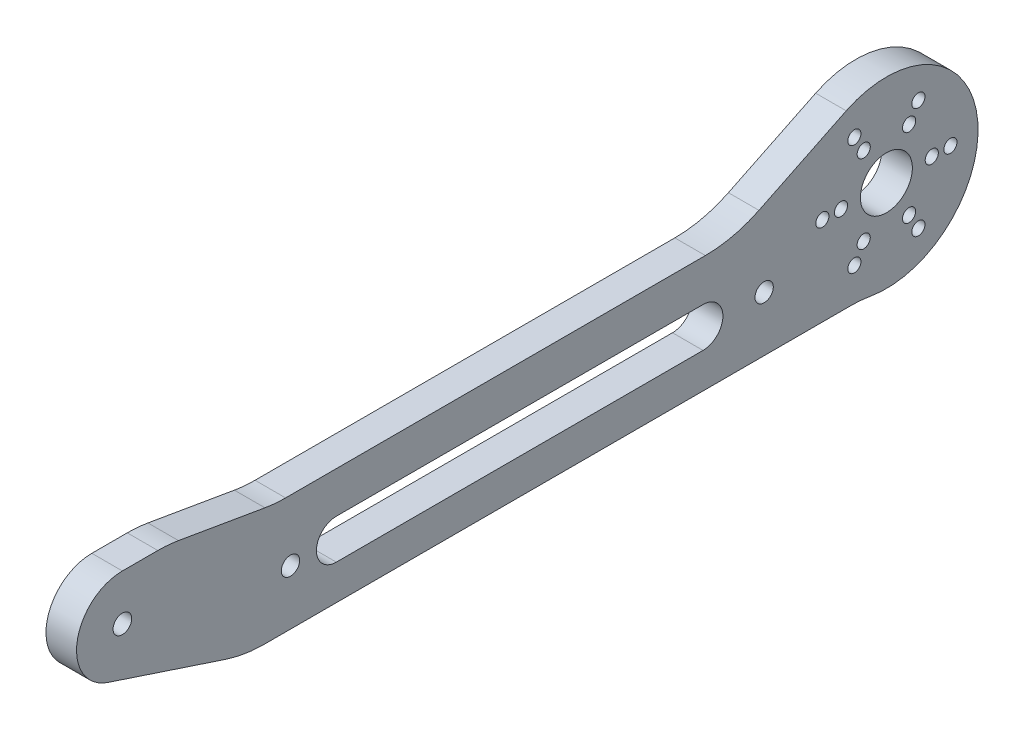
ISO-10303-21;
HEADER;
FILE_DESCRIPTION(('STEP AP214'),'2;1');
FILE_NAME('part.step','',(''),(''),'','','');
FILE_SCHEMA(('AUTOMOTIVE_DESIGN { 1 0 10303 214 1 1 1 1 }'));
ENDSEC;
DATA;
#1=APPLICATION_CONTEXT('core data for automotive mechanical design processes');
#2=APPLICATION_PROTOCOL_DEFINITION('international standard','automotive_design',2000,#1);
#3=PRODUCT_CONTEXT('',#1,'mechanical');
#4=PRODUCT('Part','Part','',(#3));
#5=PRODUCT_RELATED_PRODUCT_CATEGORY('part','',(#4));
#6=PRODUCT_DEFINITION_FORMATION('','',#4);
#7=PRODUCT_DEFINITION_CONTEXT('part definition',#1,'design');
#8=PRODUCT_DEFINITION('design','',#6,#7);
#9=PRODUCT_DEFINITION_SHAPE('','',#8);
#10=(LENGTH_UNIT() NAMED_UNIT(*) SI_UNIT(.MILLI.,.METRE.));
#11=(NAMED_UNIT(*) PLANE_ANGLE_UNIT() SI_UNIT($,.RADIAN.));
#12=(NAMED_UNIT(*) SI_UNIT($,.STERADIAN.) SOLID_ANGLE_UNIT());
#13=UNCERTAINTY_MEASURE_WITH_UNIT(LENGTH_MEASURE(1.E-05),#10,'distance_accuracy_value','');
#14=(GEOMETRIC_REPRESENTATION_CONTEXT(3) GLOBAL_UNCERTAINTY_ASSIGNED_CONTEXT((#13)) GLOBAL_UNIT_ASSIGNED_CONTEXT((#10,
#11,#12)) REPRESENTATION_CONTEXT('',''));
#15=CARTESIAN_POINT('',(0.,0.,0.));
#16=DIRECTION('',(0.,0.,1.));
#17=DIRECTION('',(1.,0.,0.));
#18=AXIS2_PLACEMENT_3D('',#15,#16,#17);
#19=CARTESIAN_POINT('',(-2.5,0.,0.));
#20=DIRECTION('',(1.,0.,0.));
#21=DIRECTION('',(0.,0.,-1.));
#22=AXIS2_PLACEMENT_3D('',#19,#20,#21);
#23=PLANE('',#22);
#24=CARTESIAN_POINT('',(-2.5,0.,125.));
#25=DIRECTION('',(-1.,0.,0.));
#26=DIRECTION('',(0.,0.,1.));
#27=AXIS2_PLACEMENT_3D('',#24,#25,#26);
#28=CIRCLE('',#27,1.525);
#29=CARTESIAN_POINT('',(-2.5,0.,126.525));
#30=VERTEX_POINT('',#29);
#31=EDGE_CURVE('E269',#30,#30,#28,.F.);
#32=ORIENTED_EDGE('',*,*,#31,.T.);
#33=EDGE_LOOP('',(#32));
#34=FACE_BOUND('',#33,.T.);
#35=CARTESIAN_POINT('',(-2.5,-5.50000000000001,97.5));
#36=DIRECTION('',(-1.,0.,0.));
#37=DIRECTION('',(0.,0.,1.));
#38=AXIS2_PLACEMENT_3D('',#35,#36,#37);
#39=CIRCLE('',#38,1.5);
#40=CARTESIAN_POINT('',(-2.5,-5.50000000000001,99.));
#41=VERTEX_POINT('',#40);
#42=EDGE_CURVE('E272',#41,#41,#39,.F.);
#43=ORIENTED_EDGE('',*,*,#42,.T.);
#44=EDGE_LOOP('',(#43));
#45=FACE_BOUND('',#44,.T.);
#46=CARTESIAN_POINT('',(-2.5,-5.5,20.));
#47=DIRECTION('',(-1.,0.,0.));
#48=DIRECTION('',(0.,0.,1.));
#49=AXIS2_PLACEMENT_3D('',#46,#47,#48);
#50=CIRCLE('',#49,1.5);
#51=CARTESIAN_POINT('',(-2.5,-5.5,21.5));
#52=VERTEX_POINT('',#51);
#53=EDGE_CURVE('E168',#52,#52,#50,.F.);
#54=ORIENTED_EDGE('',*,*,#53,.T.);
#55=EDGE_LOOP('',(#54));
#56=FACE_BOUND('',#55,.T.);
#57=DIRECTION('',(0.,0.,1.));
#58=VECTOR('',#57,1.);
#59=CARTESIAN_POINT('',(-2.5,-2.24999999999998,0.));
#60=LINE('',#59,#58);
#61=CARTESIAN_POINT('',(-2.5,-2.24999999999999,30.));
#62=VERTEX_POINT('',#61);
#63=CARTESIAN_POINT('',(-2.5,-2.25,90.));
#64=VERTEX_POINT('',#63);
#65=EDGE_CURVE('E165',#62,#64,#60,.T.);
#66=ORIENTED_EDGE('',*,*,#65,.T.);
#67=CARTESIAN_POINT('',(-2.5,-5.5,90.));
#68=DIRECTION('',(-1.,0.,0.));
#69=DIRECTION('',(0.,0.,1.));
#70=AXIS2_PLACEMENT_3D('',#67,#68,#69);
#71=CIRCLE('',#70,3.25);
#72=CARTESIAN_POINT('',(-2.5,-8.75,90.));
#73=VERTEX_POINT('',#72);
#74=EDGE_CURVE('E277',#64,#73,#71,.F.);
#75=ORIENTED_EDGE('',*,*,#74,.T.);
#76=DIRECTION('',(0.,0.,1.));
#77=VECTOR('',#76,1.);
#78=CARTESIAN_POINT('',(-2.5,-8.74999999999998,0.));
#79=LINE('',#78,#77);
#80=CARTESIAN_POINT('',(-2.5,-8.74999999999999,30.));
#81=VERTEX_POINT('',#80);
#82=EDGE_CURVE('E170',#81,#73,#79,.T.);
#83=ORIENTED_EDGE('',*,*,#82,.F.);
#84=CARTESIAN_POINT('',(-2.5,-5.49999999999999,30.));
#85=DIRECTION('',(-1.,0.,0.));
#86=DIRECTION('',(0.,0.,1.));
#87=AXIS2_PLACEMENT_3D('',#84,#85,#86);
#88=CIRCLE('',#87,3.25);
#89=EDGE_CURVE('E174',#81,#62,#88,.F.);
#90=ORIENTED_EDGE('',*,*,#89,.T.);
#91=EDGE_LOOP('',(#66,#75,#83,#90));
#92=FACE_BOUND('',#91,.T.);
#93=CARTESIAN_POINT('',(-2.5,-12.5,119.201872697098));
#94=DIRECTION('',(-1.,0.,0.));
#95=DIRECTION('',(0.,0.,1.));
#96=AXIS2_PLACEMENT_3D('',#93,#94,#95);
#97=CIRCLE('',#96,20.);
#98=CARTESIAN_POINT('',(-2.5,7.21244509626534,115.822596394881));
#99=VERTEX_POINT('',#98);
#100=CARTESIAN_POINT('',(-2.5,7.5,119.201872697098));
#101=VERTEX_POINT('',#100);
#102=EDGE_CURVE('E137',#99,#101,#97,.F.);
#103=ORIENTED_EDGE('',*,*,#102,.F.);
#104=DIRECTION('',(0.,0.168963815110846,0.985622254813267));
#105=VECTOR('',#104,1.);
#106=CARTESIAN_POINT('',(-2.5,-12.281919111816,2.10547184773989));
#107=LINE('',#106,#105);
#108=CARTESIAN_POINT('',(-2.5,4.78755490373467,101.677403605119));
#109=VERTEX_POINT('',#108);
#110=EDGE_CURVE('E132',#109,#99,#107,.T.);
#111=ORIENTED_EDGE('',*,*,#110,.F.);
#112=CARTESIAN_POINT('',(-2.5,24.5,98.2981273029019));
#113=DIRECTION('',(1.,0.,0.));
#114=DIRECTION('',(0.,0.,-1.));
#115=AXIS2_PLACEMENT_3D('',#112,#113,#114);
#116=CIRCLE('',#115,20.);
#117=CARTESIAN_POINT('',(-2.5,4.5,98.2981273029019));
#118=VERTEX_POINT('',#117);
#119=EDGE_CURVE('E283',#109,#118,#116,.T.);
#120=ORIENTED_EDGE('',*,*,#119,.T.);
#121=DIRECTION('',(0.,0.,1.));
#122=VECTOR('',#121,1.);
#123=CARTESIAN_POINT('',(-2.5,4.50000000000002,0.));
#124=LINE('',#123,#122);
#125=CARTESIAN_POINT('',(-2.5,4.50000000000001,29.6153846153846));
#126=VERTEX_POINT('',#125);
#127=EDGE_CURVE('E175',#126,#118,#124,.T.);
#128=ORIENTED_EDGE('',*,*,#127,.F.);
#129=CARTESIAN_POINT('',(-2.5,24.5,29.6153846153846));
#130=DIRECTION('',(1.,0.,0.));
#131=DIRECTION('',(0.,0.,-1.));
#132=AXIS2_PLACEMENT_3D('',#129,#130,#131);
#133=CIRCLE('',#132,20.);
#134=CARTESIAN_POINT('',(-2.5,6.52247191011236,20.8513396715644));
#135=VERTEX_POINT('',#134);
#136=EDGE_CURVE('E286',#126,#135,#133,.T.);
#137=ORIENTED_EDGE('',*,*,#136,.T.);
#138=DIRECTION('',(0.,-0.438202247191011,0.898876404494382));
#139=VECTOR('',#138,1.);
#140=CARTESIAN_POINT('',(-2.5,13.4831460674157,6.57303370786516));
#141=LINE('',#140,#139);
#142=CARTESIAN_POINT('',(-2.5,13.4831460674157,6.57303370786516));
#143=VERTEX_POINT('',#142);
#144=EDGE_CURVE('E182',#143,#135,#141,.T.);
#145=ORIENTED_EDGE('',*,*,#144,.F.);
#146=CARTESIAN_POINT('',(-2.5,0.,0.));
#147=DIRECTION('',(-1.,0.,0.));
#148=DIRECTION('',(0.,0.,1.));
#149=AXIS2_PLACEMENT_3D('',#146,#147,#148);
#150=CIRCLE('',#149,15.);
#151=CARTESIAN_POINT('',(-2.5,-14.7857142857143,2.52639131197534));
#152=VERTEX_POINT('',#151);
#153=EDGE_CURVE('E186',#152,#143,#150,.F.);
#154=ORIENTED_EDGE('',*,*,#153,.F.);
#155=CARTESIAN_POINT('',(-2.5,-34.5,5.8949130612758));
#156=DIRECTION('',(-1.,0.,0.));
#157=DIRECTION('',(0.,0.,1.));
#158=AXIS2_PLACEMENT_3D('',#155,#156,#157);
#159=CIRCLE('',#158,20.);
#160=CARTESIAN_POINT('',(-2.5,-14.5,5.8949130612758));
#161=VERTEX_POINT('',#160);
#162=EDGE_CURVE('E190',#152,#161,#159,.F.);
#163=ORIENTED_EDGE('',*,*,#162,.T.);
#164=DIRECTION('',(0.,0.,1.));
#165=VECTOR('',#164,1.);
#166=CARTESIAN_POINT('',(-2.5,-14.5,0.));
#167=LINE('',#166,#165);
#168=CARTESIAN_POINT('',(-2.5,-14.5,101.784359461928));
#169=VERTEX_POINT('',#168);
#170=EDGE_CURVE('E187',#161,#169,#167,.T.);
#171=ORIENTED_EDGE('',*,*,#170,.T.);
#172=CARTESIAN_POINT('',(-2.5,5.49999999999998,101.784359461928));
#173=DIRECTION('',(1.,0.,0.));
#174=DIRECTION('',(0.,0.,-1.));
#175=AXIS2_PLACEMENT_3D('',#172,#173,#174);
#176=CIRCLE('',#175,20.);
#177=CARTESIAN_POINT('',(-2.5,-13.4920226739072,108.05357590051));
#178=VERTEX_POINT('',#177);
#179=EDGE_CURVE('E293',#178,#169,#176,.T.);
#180=ORIENTED_EDGE('',*,*,#179,.F.);
#181=DIRECTION('',(0.,-0.313460821929136,-0.949601133695359));
#182=VECTOR('',#181,1.);
#183=CARTESIAN_POINT('',(-2.5,-44.3298524868385,14.6331670250297));
#184=LINE('',#183,#182);
#185=CARTESIAN_POINT('',(-2.5,-7.12200850271519,127.350956164469));
#186=VERTEX_POINT('',#185);
#187=EDGE_CURVE('E192',#186,#178,#184,.T.);
#188=ORIENTED_EDGE('',*,*,#187,.F.);
#189=CARTESIAN_POINT('',(-2.5,0.,125.));
#190=DIRECTION('',(-1.,0.,0.));
#191=DIRECTION('',(0.,0.,1.));
#192=AXIS2_PLACEMENT_3D('',#189,#190,#191);
#193=CIRCLE('',#192,7.50000000000001);
#194=CARTESIAN_POINT('',(-2.5,7.50000000000001,125.));
#195=VERTEX_POINT('',#194);
#196=EDGE_CURVE('E151',#195,#186,#193,.F.);
#197=ORIENTED_EDGE('',*,*,#196,.F.);
#198=DIRECTION('',(0.,0.,1.));
#199=VECTOR('',#198,1.);
#200=CARTESIAN_POINT('',(-2.5,7.4999999999998,0.));
#201=LINE('',#200,#199);
#202=EDGE_CURVE('E148',#101,#195,#201,.T.);
#203=ORIENTED_EDGE('',*,*,#202,.F.);
#204=EDGE_LOOP('',(#103,#111,#120,#128,#137,#145,#154,#163,#171,#180,#188,#197,#203));
#205=FACE_BOUND('',#204,.T.);
#206=CARTESIAN_POINT('',(-2.5,-6.43023862309946,-3.7125));
#207=DIRECTION('',(-1.,0.,0.));
#208=DIRECTION('',(0.,0.,1.));
#209=AXIS2_PLACEMENT_3D('',#206,#207,#208);
#210=CIRCLE('',#209,1.075);
#211=CARTESIAN_POINT('',(-2.5,-6.43023862309946,-2.6375));
#212=VERTEX_POINT('',#211);
#213=EDGE_CURVE('E181',#212,#212,#210,.F.);
#214=ORIENTED_EDGE('',*,*,#213,.T.);
#215=EDGE_LOOP('',(#214));
#216=FACE_BOUND('',#215,.T.);
#217=CARTESIAN_POINT('',(-2.5,-9.071616104642,-5.2375));
#218=DIRECTION('',(-1.,0.,0.));
#219=DIRECTION('',(0.,0.,1.));
#220=AXIS2_PLACEMENT_3D('',#217,#218,#219);
#221=CIRCLE('',#220,1.075);
#222=CARTESIAN_POINT('',(-2.5,-9.071616104642,-4.1625));
#223=VERTEX_POINT('',#222);
#224=EDGE_CURVE('E299',#223,#223,#221,.F.);
#225=ORIENTED_EDGE('',*,*,#224,.T.);
#226=EDGE_LOOP('',(#225));
#227=FACE_BOUND('',#226,.T.);
#228=CARTESIAN_POINT('',(-2.5,-6.43023862309946,3.7125));
#229=DIRECTION('',(-1.,0.,0.));
#230=DIRECTION('',(0.,0.,1.));
#231=AXIS2_PLACEMENT_3D('',#228,#229,#230);
#232=CIRCLE('',#231,1.075);
#233=CARTESIAN_POINT('',(-2.5,-6.43023862309946,4.7875));
#234=VERTEX_POINT('',#233);
#235=EDGE_CURVE('E302',#234,#234,#232,.F.);
#236=ORIENTED_EDGE('',*,*,#235,.T.);
#237=EDGE_LOOP('',(#236));
#238=FACE_BOUND('',#237,.T.);
#239=CARTESIAN_POINT('',(-2.5,-9.071616104642,5.2375));
#240=DIRECTION('',(-1.,0.,0.));
#241=DIRECTION('',(0.,0.,1.));
#242=AXIS2_PLACEMENT_3D('',#239,#240,#241);
#243=CIRCLE('',#242,1.075);
#244=CARTESIAN_POINT('',(-2.5,-9.071616104642,6.3125));
#245=VERTEX_POINT('',#244);
#246=EDGE_CURVE('E305',#245,#245,#243,.F.);
#247=ORIENTED_EDGE('',*,*,#246,.T.);
#248=EDGE_LOOP('',(#247));
#249=FACE_BOUND('',#248,.T.);
#250=CARTESIAN_POINT('',(-2.5,0.,7.425));
#251=DIRECTION('',(-1.,0.,0.));
#252=DIRECTION('',(0.,0.,1.));
#253=AXIS2_PLACEMENT_3D('',#250,#251,#252);
#254=CIRCLE('',#253,1.075);
#255=CARTESIAN_POINT('',(-2.5,0.,8.5));
#256=VERTEX_POINT('',#255);
#257=EDGE_CURVE('E308',#256,#256,#254,.F.);
#258=ORIENTED_EDGE('',*,*,#257,.T.);
#259=EDGE_LOOP('',(#258));
#260=FACE_BOUND('',#259,.T.);
#261=CARTESIAN_POINT('',(-2.5,0.,10.475));
#262=DIRECTION('',(-1.,0.,0.));
#263=DIRECTION('',(0.,0.,1.));
#264=AXIS2_PLACEMENT_3D('',#261,#262,#263);
#265=CIRCLE('',#264,1.075);
#266=CARTESIAN_POINT('',(-2.5,0.,11.55));
#267=VERTEX_POINT('',#266);
#268=EDGE_CURVE('E311',#267,#267,#265,.F.);
#269=ORIENTED_EDGE('',*,*,#268,.T.);
#270=EDGE_LOOP('',(#269));
#271=FACE_BOUND('',#270,.T.);
#272=CARTESIAN_POINT('',(-2.5,6.43023862309946,3.7125));
#273=DIRECTION('',(-1.,0.,0.));
#274=DIRECTION('',(0.,0.,1.));
#275=AXIS2_PLACEMENT_3D('',#272,#273,#274);
#276=CIRCLE('',#275,1.075);
#277=CARTESIAN_POINT('',(-2.5,6.43023862309946,4.7875));
#278=VERTEX_POINT('',#277);
#279=EDGE_CURVE('E314',#278,#278,#276,.F.);
#280=ORIENTED_EDGE('',*,*,#279,.T.);
#281=EDGE_LOOP('',(#280));
#282=FACE_BOUND('',#281,.T.);
#283=CARTESIAN_POINT('',(-2.5,9.07161610464199,5.23750000000001));
#284=DIRECTION('',(-1.,0.,0.));
#285=DIRECTION('',(0.,0.,1.));
#286=AXIS2_PLACEMENT_3D('',#283,#284,#285);
#287=CIRCLE('',#286,1.075);
#288=CARTESIAN_POINT('',(-2.5,9.07161610464199,6.3125));
#289=VERTEX_POINT('',#288);
#290=EDGE_CURVE('E317',#289,#289,#287,.F.);
#291=ORIENTED_EDGE('',*,*,#290,.T.);
#292=EDGE_LOOP('',(#291));
#293=FACE_BOUND('',#292,.T.);
#294=CARTESIAN_POINT('',(-2.5,6.43023862309946,-3.7125));
#295=DIRECTION('',(-1.,0.,0.));
#296=DIRECTION('',(0.,0.,1.));
#297=AXIS2_PLACEMENT_3D('',#294,#295,#296);
#298=CIRCLE('',#297,1.075);
#299=CARTESIAN_POINT('',(-2.5,6.43023862309946,-2.6375));
#300=VERTEX_POINT('',#299);
#301=EDGE_CURVE('E320',#300,#300,#298,.F.);
#302=ORIENTED_EDGE('',*,*,#301,.T.);
#303=EDGE_LOOP('',(#302));
#304=FACE_BOUND('',#303,.T.);
#305=CARTESIAN_POINT('',(-2.5,9.071616104642,-5.2375));
#306=DIRECTION('',(-1.,0.,0.));
#307=DIRECTION('',(0.,0.,1.));
#308=AXIS2_PLACEMENT_3D('',#305,#306,#307);
#309=CIRCLE('',#308,1.075);
#310=CARTESIAN_POINT('',(-2.5,9.071616104642,-4.1625));
#311=VERTEX_POINT('',#310);
#312=EDGE_CURVE('E323',#311,#311,#309,.F.);
#313=ORIENTED_EDGE('',*,*,#312,.T.);
#314=EDGE_LOOP('',(#313));
#315=FACE_BOUND('',#314,.T.);
#316=CARTESIAN_POINT('',(-2.5,0.,0.));
#317=DIRECTION('',(-1.,0.,0.));
#318=DIRECTION('',(0.,0.,1.));
#319=AXIS2_PLACEMENT_3D('',#316,#317,#318);
#320=CIRCLE('',#319,4.25);
#321=CARTESIAN_POINT('',(-2.5,0.,4.25));
#322=VERTEX_POINT('',#321);
#323=EDGE_CURVE('E326',#322,#322,#320,.F.);
#324=ORIENTED_EDGE('',*,*,#323,.T.);
#325=EDGE_LOOP('',(#324));
#326=FACE_BOUND('',#325,.T.);
#327=CARTESIAN_POINT('',(-2.5,0.,-7.425));
#328=DIRECTION('',(-1.,0.,0.));
#329=DIRECTION('',(0.,0.,1.));
#330=AXIS2_PLACEMENT_3D('',#327,#328,#329);
#331=CIRCLE('',#330,1.075);
#332=CARTESIAN_POINT('',(-2.5,0.,-6.35));
#333=VERTEX_POINT('',#332);
#334=EDGE_CURVE('E328',#333,#333,#331,.F.);
#335=ORIENTED_EDGE('',*,*,#334,.T.);
#336=EDGE_LOOP('',(#335));
#337=FACE_BOUND('',#336,.T.);
#338=CARTESIAN_POINT('',(-2.5,0.,-10.475));
#339=DIRECTION('',(-1.,0.,0.));
#340=DIRECTION('',(0.,0.,1.));
#341=AXIS2_PLACEMENT_3D('',#338,#339,#340);
#342=CIRCLE('',#341,1.075);
#343=CARTESIAN_POINT('',(-2.5,0.,-9.4));
#344=VERTEX_POINT('',#343);
#345=EDGE_CURVE('E19',#344,#344,#342,.F.);
#346=ORIENTED_EDGE('',*,*,#345,.T.);
#347=EDGE_LOOP('',(#346));
#348=FACE_BOUND('',#347,.T.);
#349=ADVANCED_FACE('F16',(#34,#45,#56,#92,#205,#216,#227,#238,#249,#260,#271,#282,#293,#304,
#315,#326,#337,#348),#23,.F.);
#350=CARTESIAN_POINT('',(2.5,0.,-10.475));
#351=DIRECTION('',(-1.,0.,0.));
#352=DIRECTION('',(0.,0.,1.));
#353=AXIS2_PLACEMENT_3D('',#350,#351,#352);
#354=CYLINDRICAL_SURFACE('',#353,1.075);
#355=CARTESIAN_POINT('',(2.5,0.,-10.475));
#356=DIRECTION('',(-1.,0.,0.));
#357=DIRECTION('',(0.,0.,1.));
#358=AXIS2_PLACEMENT_3D('',#355,#356,#357);
#359=CIRCLE('',#358,1.075);
#360=CARTESIAN_POINT('',(2.5,0.,-9.4));
#361=VERTEX_POINT('',#360);
#362=EDGE_CURVE('E266',#361,#361,#359,.T.);
#363=ORIENTED_EDGE('',*,*,#362,.F.);
#364=EDGE_LOOP('',(#363));
#365=FACE_BOUND('',#364,.T.);
#366=ORIENTED_EDGE('',*,*,#345,.F.);
#367=EDGE_LOOP('',(#366));
#368=FACE_BOUND('',#367,.T.);
#369=ADVANCED_FACE('F336',(#365,#368),#354,.F.);
#370=CARTESIAN_POINT('',(2.5,0.,-7.425));
#371=DIRECTION('',(-1.,0.,0.));
#372=DIRECTION('',(0.,0.,1.));
#373=AXIS2_PLACEMENT_3D('',#370,#371,#372);
#374=CYLINDRICAL_SURFACE('',#373,1.075);
#375=CARTESIAN_POINT('',(2.5,0.,-7.425));
#376=DIRECTION('',(-1.,0.,0.));
#377=DIRECTION('',(0.,0.,1.));
#378=AXIS2_PLACEMENT_3D('',#375,#376,#377);
#379=CIRCLE('',#378,1.075);
#380=CARTESIAN_POINT('',(2.5,0.,-6.35));
#381=VERTEX_POINT('',#380);
#382=EDGE_CURVE('E263',#381,#381,#379,.T.);
#383=ORIENTED_EDGE('',*,*,#382,.F.);
#384=EDGE_LOOP('',(#383));
#385=FACE_BOUND('',#384,.T.);
#386=ORIENTED_EDGE('',*,*,#334,.F.);
#387=EDGE_LOOP('',(#386));
#388=FACE_BOUND('',#387,.T.);
#389=ADVANCED_FACE('F338',(#385,#388),#374,.F.);
#390=CARTESIAN_POINT('',(2.5,0.,0.));
#391=DIRECTION('',(-1.,0.,0.));
#392=DIRECTION('',(0.,0.,1.));
#393=AXIS2_PLACEMENT_3D('',#390,#391,#392);
#394=CYLINDRICAL_SURFACE('',#393,4.25);
#395=CARTESIAN_POINT('',(2.5,0.,0.));
#396=DIRECTION('',(-1.,0.,0.));
#397=DIRECTION('',(0.,0.,1.));
#398=AXIS2_PLACEMENT_3D('',#395,#396,#397);
#399=CIRCLE('',#398,4.25);
#400=CARTESIAN_POINT('',(2.5,0.,4.25));
#401=VERTEX_POINT('',#400);
#402=EDGE_CURVE('E260',#401,#401,#399,.T.);
#403=ORIENTED_EDGE('',*,*,#402,.F.);
#404=EDGE_LOOP('',(#403));
#405=FACE_BOUND('',#404,.T.);
#406=ORIENTED_EDGE('',*,*,#323,.F.);
#407=EDGE_LOOP('',(#406));
#408=FACE_BOUND('',#407,.T.);
#409=ADVANCED_FACE('F345',(#405,#408),#394,.F.);
#410=CARTESIAN_POINT('',(2.5,9.071616104642,-5.2375));
#411=DIRECTION('',(-1.,0.,0.));
#412=DIRECTION('',(0.,0.,1.));
#413=AXIS2_PLACEMENT_3D('',#410,#411,#412);
#414=CYLINDRICAL_SURFACE('',#413,1.075);
#415=CARTESIAN_POINT('',(2.5,9.071616104642,-5.2375));
#416=DIRECTION('',(-1.,0.,0.));
#417=DIRECTION('',(0.,0.,1.));
#418=AXIS2_PLACEMENT_3D('',#415,#416,#417);
#419=CIRCLE('',#418,1.075);
#420=CARTESIAN_POINT('',(2.5,9.071616104642,-4.1625));
#421=VERTEX_POINT('',#420);
#422=EDGE_CURVE('E257',#421,#421,#419,.T.);
#423=ORIENTED_EDGE('',*,*,#422,.F.);
#424=EDGE_LOOP('',(#423));
#425=FACE_BOUND('',#424,.T.);
#426=ORIENTED_EDGE('',*,*,#312,.F.);
#427=EDGE_LOOP('',(#426));
#428=FACE_BOUND('',#427,.T.);
#429=ADVANCED_FACE('F468',(#425,#428),#414,.F.);
#430=CARTESIAN_POINT('',(2.5,6.43023862309946,-3.7125));
#431=DIRECTION('',(-1.,0.,0.));
#432=DIRECTION('',(0.,0.,1.));
#433=AXIS2_PLACEMENT_3D('',#430,#431,#432);
#434=CYLINDRICAL_SURFACE('',#433,1.075);
#435=CARTESIAN_POINT('',(2.5,6.43023862309946,-3.7125));
#436=DIRECTION('',(-1.,0.,0.));
#437=DIRECTION('',(0.,0.,1.));
#438=AXIS2_PLACEMENT_3D('',#435,#436,#437);
#439=CIRCLE('',#438,1.075);
#440=CARTESIAN_POINT('',(2.5,6.43023862309946,-2.6375));
#441=VERTEX_POINT('',#440);
#442=EDGE_CURVE('E254',#441,#441,#439,.T.);
#443=ORIENTED_EDGE('',*,*,#442,.F.);
#444=EDGE_LOOP('',(#443));
#445=FACE_BOUND('',#444,.T.);
#446=ORIENTED_EDGE('',*,*,#301,.F.);
#447=EDGE_LOOP('',(#446));
#448=FACE_BOUND('',#447,.T.);
#449=ADVANCED_FACE('F464',(#445,#448),#434,.F.);
#450=CARTESIAN_POINT('',(2.5,9.07161610464199,5.23750000000001));
#451=DIRECTION('',(-1.,0.,0.));
#452=DIRECTION('',(0.,0.,1.));
#453=AXIS2_PLACEMENT_3D('',#450,#451,#452);
#454=CYLINDRICAL_SURFACE('',#453,1.075);
#455=CARTESIAN_POINT('',(2.5,9.07161610464199,5.23750000000001));
#456=DIRECTION('',(-1.,0.,0.));
#457=DIRECTION('',(0.,0.,1.));
#458=AXIS2_PLACEMENT_3D('',#455,#456,#457);
#459=CIRCLE('',#458,1.075);
#460=CARTESIAN_POINT('',(2.5,9.07161610464199,6.3125));
#461=VERTEX_POINT('',#460);
#462=EDGE_CURVE('E251',#461,#461,#459,.T.);
#463=ORIENTED_EDGE('',*,*,#462,.F.);
#464=EDGE_LOOP('',(#463));
#465=FACE_BOUND('',#464,.T.);
#466=ORIENTED_EDGE('',*,*,#290,.F.);
#467=EDGE_LOOP('',(#466));
#468=FACE_BOUND('',#467,.T.);
#469=ADVANCED_FACE('F460',(#465,#468),#454,.F.);
#470=CARTESIAN_POINT('',(2.5,6.43023862309946,3.7125));
#471=DIRECTION('',(-1.,0.,0.));
#472=DIRECTION('',(0.,0.,1.));
#473=AXIS2_PLACEMENT_3D('',#470,#471,#472);
#474=CYLINDRICAL_SURFACE('',#473,1.075);
#475=CARTESIAN_POINT('',(2.5,6.43023862309946,3.7125));
#476=DIRECTION('',(-1.,0.,0.));
#477=DIRECTION('',(0.,0.,1.));
#478=AXIS2_PLACEMENT_3D('',#475,#476,#477);
#479=CIRCLE('',#478,1.075);
#480=CARTESIAN_POINT('',(2.5,6.43023862309946,4.7875));
#481=VERTEX_POINT('',#480);
#482=EDGE_CURVE('E248',#481,#481,#479,.T.);
#483=ORIENTED_EDGE('',*,*,#482,.F.);
#484=EDGE_LOOP('',(#483));
#485=FACE_BOUND('',#484,.T.);
#486=ORIENTED_EDGE('',*,*,#279,.F.);
#487=EDGE_LOOP('',(#486));
#488=FACE_BOUND('',#487,.T.);
#489=ADVANCED_FACE('F456',(#485,#488),#474,.F.);
#490=CARTESIAN_POINT('',(2.5,0.,10.475));
#491=DIRECTION('',(-1.,0.,0.));
#492=DIRECTION('',(0.,0.,1.));
#493=AXIS2_PLACEMENT_3D('',#490,#491,#492);
#494=CYLINDRICAL_SURFACE('',#493,1.075);
#495=CARTESIAN_POINT('',(2.5,0.,10.475));
#496=DIRECTION('',(-1.,0.,0.));
#497=DIRECTION('',(0.,0.,1.));
#498=AXIS2_PLACEMENT_3D('',#495,#496,#497);
#499=CIRCLE('',#498,1.075);
#500=CARTESIAN_POINT('',(2.5,0.,11.55));
#501=VERTEX_POINT('',#500);
#502=EDGE_CURVE('E245',#501,#501,#499,.T.);
#503=ORIENTED_EDGE('',*,*,#502,.F.);
#504=EDGE_LOOP('',(#503));
#505=FACE_BOUND('',#504,.T.);
#506=ORIENTED_EDGE('',*,*,#268,.F.);
#507=EDGE_LOOP('',(#506));
#508=FACE_BOUND('',#507,.T.);
#509=ADVANCED_FACE('F452',(#505,#508),#494,.F.);
#510=CARTESIAN_POINT('',(2.5,0.,7.425));
#511=DIRECTION('',(-1.,0.,0.));
#512=DIRECTION('',(0.,0.,1.));
#513=AXIS2_PLACEMENT_3D('',#510,#511,#512);
#514=CYLINDRICAL_SURFACE('',#513,1.075);
#515=CARTESIAN_POINT('',(2.5,0.,7.425));
#516=DIRECTION('',(-1.,0.,0.));
#517=DIRECTION('',(0.,0.,1.));
#518=AXIS2_PLACEMENT_3D('',#515,#516,#517);
#519=CIRCLE('',#518,1.075);
#520=CARTESIAN_POINT('',(2.5,0.,8.5));
#521=VERTEX_POINT('',#520);
#522=EDGE_CURVE('E242',#521,#521,#519,.T.);
#523=ORIENTED_EDGE('',*,*,#522,.F.);
#524=EDGE_LOOP('',(#523));
#525=FACE_BOUND('',#524,.T.);
#526=ORIENTED_EDGE('',*,*,#257,.F.);
#527=EDGE_LOOP('',(#526));
#528=FACE_BOUND('',#527,.T.);
#529=ADVANCED_FACE('F448',(#525,#528),#514,.F.);
#530=CARTESIAN_POINT('',(2.5,-9.071616104642,5.2375));
#531=DIRECTION('',(-1.,0.,0.));
#532=DIRECTION('',(0.,0.,1.));
#533=AXIS2_PLACEMENT_3D('',#530,#531,#532);
#534=CYLINDRICAL_SURFACE('',#533,1.075);
#535=CARTESIAN_POINT('',(2.5,-9.071616104642,5.2375));
#536=DIRECTION('',(-1.,0.,0.));
#537=DIRECTION('',(0.,0.,1.));
#538=AXIS2_PLACEMENT_3D('',#535,#536,#537);
#539=CIRCLE('',#538,1.075);
#540=CARTESIAN_POINT('',(2.5,-9.071616104642,6.3125));
#541=VERTEX_POINT('',#540);
#542=EDGE_CURVE('E239',#541,#541,#539,.T.);
#543=ORIENTED_EDGE('',*,*,#542,.F.);
#544=EDGE_LOOP('',(#543));
#545=FACE_BOUND('',#544,.T.);
#546=ORIENTED_EDGE('',*,*,#246,.F.);
#547=EDGE_LOOP('',(#546));
#548=FACE_BOUND('',#547,.T.);
#549=ADVANCED_FACE('F444',(#545,#548),#534,.F.);
#550=CARTESIAN_POINT('',(2.5,-6.43023862309946,3.7125));
#551=DIRECTION('',(-1.,0.,0.));
#552=DIRECTION('',(0.,0.,1.));
#553=AXIS2_PLACEMENT_3D('',#550,#551,#552);
#554=CYLINDRICAL_SURFACE('',#553,1.075);
#555=CARTESIAN_POINT('',(2.5,-6.43023862309946,3.7125));
#556=DIRECTION('',(-1.,0.,0.));
#557=DIRECTION('',(0.,0.,1.));
#558=AXIS2_PLACEMENT_3D('',#555,#556,#557);
#559=CIRCLE('',#558,1.075);
#560=CARTESIAN_POINT('',(2.5,-6.43023862309946,4.7875));
#561=VERTEX_POINT('',#560);
#562=EDGE_CURVE('E236',#561,#561,#559,.T.);
#563=ORIENTED_EDGE('',*,*,#562,.F.);
#564=EDGE_LOOP('',(#563));
#565=FACE_BOUND('',#564,.T.);
#566=ORIENTED_EDGE('',*,*,#235,.F.);
#567=EDGE_LOOP('',(#566));
#568=FACE_BOUND('',#567,.T.);
#569=ADVANCED_FACE('F440',(#565,#568),#554,.F.);
#570=CARTESIAN_POINT('',(2.5,-9.071616104642,-5.2375));
#571=DIRECTION('',(-1.,0.,0.));
#572=DIRECTION('',(0.,0.,1.));
#573=AXIS2_PLACEMENT_3D('',#570,#571,#572);
#574=CYLINDRICAL_SURFACE('',#573,1.075);
#575=CARTESIAN_POINT('',(2.5,-9.071616104642,-5.2375));
#576=DIRECTION('',(-1.,0.,0.));
#577=DIRECTION('',(0.,0.,1.));
#578=AXIS2_PLACEMENT_3D('',#575,#576,#577);
#579=CIRCLE('',#578,1.075);
#580=CARTESIAN_POINT('',(2.5,-9.071616104642,-4.1625));
#581=VERTEX_POINT('',#580);
#582=EDGE_CURVE('E233',#581,#581,#579,.T.);
#583=ORIENTED_EDGE('',*,*,#582,.F.);
#584=EDGE_LOOP('',(#583));
#585=FACE_BOUND('',#584,.T.);
#586=ORIENTED_EDGE('',*,*,#224,.F.);
#587=EDGE_LOOP('',(#586));
#588=FACE_BOUND('',#587,.T.);
#589=ADVANCED_FACE('F436',(#585,#588),#574,.F.);
#590=CARTESIAN_POINT('',(2.5,-6.43023862309946,-3.7125));
#591=DIRECTION('',(-1.,0.,0.));
#592=DIRECTION('',(0.,0.,1.));
#593=AXIS2_PLACEMENT_3D('',#590,#591,#592);
#594=CYLINDRICAL_SURFACE('',#593,1.075);
#595=CARTESIAN_POINT('',(2.5,-6.43023862309946,-3.7125));
#596=DIRECTION('',(-1.,0.,0.));
#597=DIRECTION('',(0.,0.,1.));
#598=AXIS2_PLACEMENT_3D('',#595,#596,#597);
#599=CIRCLE('',#598,1.075);
#600=CARTESIAN_POINT('',(2.5,-6.43023862309946,-2.6375));
#601=VERTEX_POINT('',#600);
#602=EDGE_CURVE('E230',#601,#601,#599,.T.);
#603=ORIENTED_EDGE('',*,*,#602,.F.);
#604=EDGE_LOOP('',(#603));
#605=FACE_BOUND('',#604,.T.);
#606=ORIENTED_EDGE('',*,*,#213,.F.);
#607=EDGE_LOOP('',(#606));
#608=FACE_BOUND('',#607,.T.);
#609=ADVANCED_FACE('F433',(#605,#608),#594,.F.);
#610=CARTESIAN_POINT('',(2.5,-12.281919111816,2.10547184773989));
#611=DIRECTION('',(0.,0.985622254813267,-0.168963815110846));
#612=DIRECTION('',(0.,0.168963815110846,0.985622254813267));
#613=AXIS2_PLACEMENT_3D('',#610,#611,#612);
#614=PLANE('',#613);
#615=DIRECTION('',(0.,0.168963815110846,0.985622254813267));
#616=VECTOR('',#615,1.);
#617=CARTESIAN_POINT('',(2.5,4.78755490373467,101.677403605119));
#618=LINE('',#617,#616);
#619=CARTESIAN_POINT('',(2.5,4.78755490373467,101.677403605119));
#620=VERTEX_POINT('',#619);
#621=CARTESIAN_POINT('',(2.5,7.21244509626533,115.822596394881));
#622=VERTEX_POINT('',#621);
#623=EDGE_CURVE('E229',#620,#622,#618,.T.);
#624=ORIENTED_EDGE('',*,*,#623,.F.);
#625=DIRECTION('',(1.,0.,0.));
#626=VECTOR('',#625,1.);
#627=CARTESIAN_POINT('',(2.5,4.78755490373467,101.677403605119));
#628=LINE('',#627,#626);
#629=EDGE_CURVE('E285',#620,#109,#628,.F.);
#630=ORIENTED_EDGE('',*,*,#629,.T.);
#631=ORIENTED_EDGE('',*,*,#110,.T.);
#632=DIRECTION('',(-1.,0.,0.));
#633=VECTOR('',#632,1.);
#634=CARTESIAN_POINT('',(2.5,7.21244509626533,115.822596394881));
#635=LINE('',#634,#633);
#636=EDGE_CURVE('E144',#622,#99,#635,.T.);
#637=ORIENTED_EDGE('',*,*,#636,.F.);
#638=EDGE_LOOP('',(#624,#630,#631,#637));
#639=FACE_BOUND('',#638,.T.);
#640=ADVANCED_FACE('F430',(#639),#614,.T.);
#641=CARTESIAN_POINT('',(2.5,-12.5,119.201872697098));
#642=DIRECTION('',(-1.,0.,0.));
#643=DIRECTION('',(0.,0.,1.));
#644=AXIS2_PLACEMENT_3D('',#641,#642,#643);
#645=CYLINDRICAL_SURFACE('',#644,20.);
#646=ORIENTED_EDGE('',*,*,#102,.T.);
#647=DIRECTION('',(1.,0.,0.));
#648=VECTOR('',#647,1.);
#649=CARTESIAN_POINT('',(2.5,7.5,119.201872697098));
#650=LINE('',#649,#648);
#651=CARTESIAN_POINT('',(2.5,7.5,119.201872697098));
#652=VERTEX_POINT('',#651);
#653=EDGE_CURVE('E142',#652,#101,#650,.F.);
#654=ORIENTED_EDGE('',*,*,#653,.F.);
#655=CARTESIAN_POINT('',(2.5,-12.5,119.201872697098));
#656=DIRECTION('',(-1.,0.,0.));
#657=DIRECTION('',(0.,0.,1.));
#658=AXIS2_PLACEMENT_3D('',#655,#656,#657);
#659=CIRCLE('',#658,20.);
#660=EDGE_CURVE('E227',#622,#652,#659,.F.);
#661=ORIENTED_EDGE('',*,*,#660,.F.);
#662=ORIENTED_EDGE('',*,*,#636,.T.);
#663=EDGE_LOOP('',(#646,#654,#661,#662));
#664=FACE_BOUND('',#663,.T.);
#665=ADVANCED_FACE('F139',(#664),#645,.T.);
#666=CARTESIAN_POINT('',(2.5,7.4999999999998,0.));
#667=DIRECTION('',(0.,1.,0.));
#668=DIRECTION('',(0.,0.,1.));
#669=AXIS2_PLACEMENT_3D('',#666,#667,#668);
#670=PLANE('',#669);
#671=ORIENTED_EDGE('',*,*,#202,.T.);
#672=DIRECTION('',(-1.,0.,0.));
#673=VECTOR('',#672,1.);
#674=CARTESIAN_POINT('',(2.5,7.50000000000001,125.));
#675=LINE('',#674,#673);
#676=CARTESIAN_POINT('',(2.5,7.50000000000001,125.));
#677=VERTEX_POINT('',#676);
#678=EDGE_CURVE('E154',#677,#195,#675,.T.);
#679=ORIENTED_EDGE('',*,*,#678,.F.);
#680=DIRECTION('',(0.,0.,-1.));
#681=VECTOR('',#680,1.);
#682=CARTESIAN_POINT('',(2.5,7.5,0.));
#683=LINE('',#682,#681);
#684=EDGE_CURVE('E158',#652,#677,#683,.F.);
#685=ORIENTED_EDGE('',*,*,#684,.F.);
#686=ORIENTED_EDGE('',*,*,#653,.T.);
#687=EDGE_LOOP('',(#671,#679,#685,#686));
#688=FACE_BOUND('',#687,.T.);
#689=ADVANCED_FACE('F156',(#688),#670,.T.);
#690=CARTESIAN_POINT('',(2.5,0.,125.));
#691=DIRECTION('',(-1.,0.,0.));
#692=DIRECTION('',(0.,0.,1.));
#693=AXIS2_PLACEMENT_3D('',#690,#691,#692);
#694=CYLINDRICAL_SURFACE('',#693,7.50000000000001);
#695=ORIENTED_EDGE('',*,*,#196,.T.);
#696=DIRECTION('',(1.,0.,0.));
#697=VECTOR('',#696,1.);
#698=CARTESIAN_POINT('',(2.5,-7.12200850271519,127.350956164469));
#699=LINE('',#698,#697);
#700=CARTESIAN_POINT('',(2.5,-7.12200850271519,127.350956164469));
#701=VERTEX_POINT('',#700);
#702=EDGE_CURVE('E193',#701,#186,#699,.F.);
#703=ORIENTED_EDGE('',*,*,#702,.F.);
#704=CARTESIAN_POINT('',(2.5,0.,125.));
#705=DIRECTION('',(-1.,0.,0.));
#706=DIRECTION('',(0.,0.,1.));
#707=AXIS2_PLACEMENT_3D('',#704,#705,#706);
#708=CIRCLE('',#707,7.50000000000001);
#709=EDGE_CURVE('E225',#677,#701,#708,.F.);
#710=ORIENTED_EDGE('',*,*,#709,.F.);
#711=ORIENTED_EDGE('',*,*,#678,.T.);
#712=EDGE_LOOP('',(#695,#703,#710,#711));
#713=FACE_BOUND('',#712,.T.);
#714=ADVANCED_FACE('F421',(#713),#694,.T.);
#715=CARTESIAN_POINT('',(2.5,-44.3298524868385,14.6331670250297));
#716=DIRECTION('',(0.,-0.949601133695359,0.313460821929136));
#717=DIRECTION('',(0.,-0.313460821929136,-0.949601133695359));
#718=AXIS2_PLACEMENT_3D('',#715,#716,#717);
#719=PLANE('',#718);
#720=DIRECTION('',(0.,-0.313460821929136,-0.949601133695359));
#721=VECTOR('',#720,1.);
#722=CARTESIAN_POINT('',(2.5,-7.1220085027152,127.350956164469));
#723=LINE('',#722,#721);
#724=CARTESIAN_POINT('',(2.5,-13.4920226739072,108.05357590051));
#725=VERTEX_POINT('',#724);
#726=EDGE_CURVE('E224',#701,#725,#723,.T.);
#727=ORIENTED_EDGE('',*,*,#726,.F.);
#728=ORIENTED_EDGE('',*,*,#702,.T.);
#729=ORIENTED_EDGE('',*,*,#187,.T.);
#730=DIRECTION('',(1.,0.,0.));
#731=VECTOR('',#730,1.);
#732=CARTESIAN_POINT('',(2.5,-13.4920226739072,108.05357590051));
#733=LINE('',#732,#731);
#734=EDGE_CURVE('E295',#725,#178,#733,.F.);
#735=ORIENTED_EDGE('',*,*,#734,.F.);
#736=EDGE_LOOP('',(#727,#728,#729,#735));
#737=FACE_BOUND('',#736,.T.);
#738=ADVANCED_FACE('F417',(#737),#719,.T.);
#739=CARTESIAN_POINT('',(2.5,5.49999999999998,101.784359461928));
#740=DIRECTION('',(1.,0.,0.));
#741=DIRECTION('',(0.,0.,-1.));
#742=AXIS2_PLACEMENT_3D('',#739,#740,#741);
#743=CYLINDRICAL_SURFACE('',#742,20.);
#744=ORIENTED_EDGE('',*,*,#179,.T.);
#745=DIRECTION('',(1.,0.,0.));
#746=VECTOR('',#745,1.);
#747=CARTESIAN_POINT('',(2.5,-14.5,101.784359461928));
#748=LINE('',#747,#746);
#749=CARTESIAN_POINT('',(2.5,-14.5,101.784359461928));
#750=VERTEX_POINT('',#749);
#751=EDGE_CURVE('E191',#169,#750,#748,.T.);
#752=ORIENTED_EDGE('',*,*,#751,.T.);
#753=CARTESIAN_POINT('',(2.5,5.49999999999998,101.784359461928));
#754=DIRECTION('',(1.,0.,0.));
#755=DIRECTION('',(0.,0.,-1.));
#756=AXIS2_PLACEMENT_3D('',#753,#754,#755);
#757=CIRCLE('',#756,20.);
#758=EDGE_CURVE('E221',#725,#750,#757,.T.);
#759=ORIENTED_EDGE('',*,*,#758,.F.);
#760=ORIENTED_EDGE('',*,*,#734,.T.);
#761=EDGE_LOOP('',(#744,#752,#759,#760));
#762=FACE_BOUND('',#761,.T.);
#763=ADVANCED_FACE('F413',(#762),#743,.T.);
#764=CARTESIAN_POINT('',(2.5,-14.5,0.));
#765=DIRECTION('',(0.,1.,0.));
#766=DIRECTION('',(0.,0.,1.));
#767=AXIS2_PLACEMENT_3D('',#764,#765,#766);
#768=PLANE('',#767);
#769=DIRECTION('',(-1.,0.,0.));
#770=VECTOR('',#769,1.);
#771=CARTESIAN_POINT('',(2.5,-14.5,5.8949130612758));
#772=LINE('',#771,#770);
#773=CARTESIAN_POINT('',(2.5,-14.5,5.8949130612758));
#774=VERTEX_POINT('',#773);
#775=EDGE_CURVE('E292',#161,#774,#772,.F.);
#776=ORIENTED_EDGE('',*,*,#775,.T.);
#777=DIRECTION('',(0.,0.,-1.));
#778=VECTOR('',#777,1.);
#779=CARTESIAN_POINT('',(2.5,-14.5,0.));
#780=LINE('',#779,#778);
#781=EDGE_CURVE('E220',#750,#774,#780,.T.);
#782=ORIENTED_EDGE('',*,*,#781,.F.);
#783=ORIENTED_EDGE('',*,*,#751,.F.);
#784=ORIENTED_EDGE('',*,*,#170,.F.);
#785=EDGE_LOOP('',(#776,#782,#783,#784));
#786=FACE_BOUND('',#785,.T.);
#787=ADVANCED_FACE('F409',(#786),#768,.F.);
#788=CARTESIAN_POINT('',(2.5,-34.5,5.8949130612758));
#789=DIRECTION('',(-1.,0.,0.));
#790=DIRECTION('',(0.,0.,1.));
#791=AXIS2_PLACEMENT_3D('',#788,#789,#790);
#792=CYLINDRICAL_SURFACE('',#791,20.);
#793=ORIENTED_EDGE('',*,*,#775,.F.);
#794=ORIENTED_EDGE('',*,*,#162,.F.);
#795=DIRECTION('',(-1.,0.,0.));
#796=VECTOR('',#795,1.);
#797=CARTESIAN_POINT('',(2.5,-14.7857142857143,2.52639131197534));
#798=LINE('',#797,#796);
#799=CARTESIAN_POINT('',(2.5,-14.7857142857143,2.52639131197534));
#800=VERTEX_POINT('',#799);
#801=EDGE_CURVE('E290',#800,#152,#798,.T.);
#802=ORIENTED_EDGE('',*,*,#801,.F.);
#803=CARTESIAN_POINT('',(2.5,-34.5,5.8949130612758));
#804=DIRECTION('',(-1.,0.,0.));
#805=DIRECTION('',(0.,0.,1.));
#806=AXIS2_PLACEMENT_3D('',#803,#804,#805);
#807=CIRCLE('',#806,20.);
#808=EDGE_CURVE('E217',#774,#800,#807,.T.);
#809=ORIENTED_EDGE('',*,*,#808,.F.);
#810=EDGE_LOOP('',(#793,#794,#802,#809));
#811=FACE_BOUND('',#810,.T.);
#812=ADVANCED_FACE('F405',(#811),#792,.F.);
#813=CARTESIAN_POINT('',(2.5,0.,0.));
#814=DIRECTION('',(-1.,0.,0.));
#815=DIRECTION('',(0.,0.,1.));
#816=AXIS2_PLACEMENT_3D('',#813,#814,#815);
#817=CYLINDRICAL_SURFACE('',#816,15.);
#818=ORIENTED_EDGE('',*,*,#153,.T.);
#819=DIRECTION('',(1.,0.,0.));
#820=VECTOR('',#819,1.);
#821=CARTESIAN_POINT('',(2.5,13.4831460674157,6.57303370786516));
#822=LINE('',#821,#820);
#823=CARTESIAN_POINT('',(2.5,13.4831460674157,6.57303370786516));
#824=VERTEX_POINT('',#823);
#825=EDGE_CURVE('E185',#824,#143,#822,.F.);
#826=ORIENTED_EDGE('',*,*,#825,.F.);
#827=CARTESIAN_POINT('',(2.5,0.,0.));
#828=DIRECTION('',(-1.,0.,0.));
#829=DIRECTION('',(0.,0.,1.));
#830=AXIS2_PLACEMENT_3D('',#827,#828,#829);
#831=CIRCLE('',#830,15.);
#832=EDGE_CURVE('E214',#800,#824,#831,.F.);
#833=ORIENTED_EDGE('',*,*,#832,.F.);
#834=ORIENTED_EDGE('',*,*,#801,.T.);
#835=EDGE_LOOP('',(#818,#826,#833,#834));
#836=FACE_BOUND('',#835,.T.);
#837=ADVANCED_FACE('F401',(#836),#817,.T.);
#838=CARTESIAN_POINT('',(2.5,13.4831460674157,6.57303370786516));
#839=DIRECTION('',(0.,0.898876404494382,0.438202247191011));
#840=DIRECTION('',(0.,-0.438202247191011,0.898876404494382));
#841=AXIS2_PLACEMENT_3D('',#838,#839,#840);
#842=PLANE('',#841);
#843=DIRECTION('',(0.,-0.438202247191011,0.898876404494382));
#844=VECTOR('',#843,1.);
#845=CARTESIAN_POINT('',(2.5,13.4831460674157,6.57303370786516));
#846=LINE('',#845,#844);
#847=CARTESIAN_POINT('',(2.5,6.52247191011236,20.8513396715644));
#848=VERTEX_POINT('',#847);
#849=EDGE_CURVE('E213',#824,#848,#846,.T.);
#850=ORIENTED_EDGE('',*,*,#849,.F.);
#851=ORIENTED_EDGE('',*,*,#825,.T.);
#852=ORIENTED_EDGE('',*,*,#144,.T.);
#853=DIRECTION('',(1.,0.,0.));
#854=VECTOR('',#853,1.);
#855=CARTESIAN_POINT('',(2.5,6.52247191011236,20.8513396715644));
#856=LINE('',#855,#854);
#857=EDGE_CURVE('E179',#135,#848,#856,.T.);
#858=ORIENTED_EDGE('',*,*,#857,.T.);
#859=EDGE_LOOP('',(#850,#851,#852,#858));
#860=FACE_BOUND('',#859,.T.);
#861=ADVANCED_FACE('F397',(#860),#842,.T.);
#862=CARTESIAN_POINT('',(2.5,24.5,29.6153846153846));
#863=DIRECTION('',(1.,0.,0.));
#864=DIRECTION('',(0.,0.,-1.));
#865=AXIS2_PLACEMENT_3D('',#862,#863,#864);
#866=CYLINDRICAL_SURFACE('',#865,20.);
#867=ORIENTED_EDGE('',*,*,#857,.F.);
#868=ORIENTED_EDGE('',*,*,#136,.F.);
#869=DIRECTION('',(1.,0.,0.));
#870=VECTOR('',#869,1.);
#871=CARTESIAN_POINT('',(2.5,4.50000000000001,29.6153846153846));
#872=LINE('',#871,#870);
#873=CARTESIAN_POINT('',(2.5,4.50000000000001,29.6153846153846));
#874=VERTEX_POINT('',#873);
#875=EDGE_CURVE('E178',#874,#126,#872,.F.);
#876=ORIENTED_EDGE('',*,*,#875,.F.);
#877=CARTESIAN_POINT('',(2.5,24.5,29.6153846153846));
#878=DIRECTION('',(1.,0.,0.));
#879=DIRECTION('',(0.,0.,-1.));
#880=AXIS2_PLACEMENT_3D('',#877,#878,#879);
#881=CIRCLE('',#880,20.);
#882=EDGE_CURVE('E210',#848,#874,#881,.F.);
#883=ORIENTED_EDGE('',*,*,#882,.F.);
#884=EDGE_LOOP('',(#867,#868,#876,#883));
#885=FACE_BOUND('',#884,.T.);
#886=ADVANCED_FACE('F393',(#885),#866,.F.);
#887=CARTESIAN_POINT('',(2.5,4.50000000000002,0.));
#888=DIRECTION('',(0.,1.,0.));
#889=DIRECTION('',(0.,0.,1.));
#890=AXIS2_PLACEMENT_3D('',#887,#888,#889);
#891=PLANE('',#890);
#892=DIRECTION('',(0.,0.,-1.));
#893=VECTOR('',#892,1.);
#894=CARTESIAN_POINT('',(2.5,4.50000000000001,0.));
#895=LINE('',#894,#893);
#896=CARTESIAN_POINT('',(2.5,4.5,98.2981273029019));
#897=VERTEX_POINT('',#896);
#898=EDGE_CURVE('E209',#874,#897,#895,.F.);
#899=ORIENTED_EDGE('',*,*,#898,.F.);
#900=ORIENTED_EDGE('',*,*,#875,.T.);
#901=ORIENTED_EDGE('',*,*,#127,.T.);
#902=DIRECTION('',(1.,0.,0.));
#903=VECTOR('',#902,1.);
#904=CARTESIAN_POINT('',(2.5,4.5,98.2981273029019));
#905=LINE('',#904,#903);
#906=EDGE_CURVE('E282',#118,#897,#905,.T.);
#907=ORIENTED_EDGE('',*,*,#906,.T.);
#908=EDGE_LOOP('',(#899,#900,#901,#907));
#909=FACE_BOUND('',#908,.T.);
#910=ADVANCED_FACE('F389',(#909),#891,.T.);
#911=CARTESIAN_POINT('',(2.5,24.5,98.2981273029019));
#912=DIRECTION('',(1.,0.,0.));
#913=DIRECTION('',(0.,0.,-1.));
#914=AXIS2_PLACEMENT_3D('',#911,#912,#913);
#915=CYLINDRICAL_SURFACE('',#914,20.);
#916=ORIENTED_EDGE('',*,*,#906,.F.);
#917=ORIENTED_EDGE('',*,*,#119,.F.);
#918=ORIENTED_EDGE('',*,*,#629,.F.);
#919=CARTESIAN_POINT('',(2.5,24.5,98.2981273029019));
#920=DIRECTION('',(1.,0.,0.));
#921=DIRECTION('',(0.,0.,-1.));
#922=AXIS2_PLACEMENT_3D('',#919,#920,#921);
#923=CIRCLE('',#922,20.);
#924=EDGE_CURVE('E206',#897,#620,#923,.F.);
#925=ORIENTED_EDGE('',*,*,#924,.F.);
#926=EDGE_LOOP('',(#916,#917,#918,#925));
#927=FACE_BOUND('',#926,.T.);
#928=ADVANCED_FACE('F385',(#927),#915,.F.);
#929=CARTESIAN_POINT('',(2.5,-5.49999999999999,30.));
#930=DIRECTION('',(-1.,0.,0.));
#931=DIRECTION('',(0.,0.,1.));
#932=AXIS2_PLACEMENT_3D('',#929,#930,#931);
#933=CYLINDRICAL_SURFACE('',#932,3.25);
#934=DIRECTION('',(1.,0.,0.));
#935=VECTOR('',#934,1.);
#936=CARTESIAN_POINT('',(2.5,-8.74999999999999,30.));
#937=LINE('',#936,#935);
#938=CARTESIAN_POINT('',(2.5,-8.74999999999999,30.));
#939=VERTEX_POINT('',#938);
#940=EDGE_CURVE('E173',#939,#81,#937,.F.);
#941=ORIENTED_EDGE('',*,*,#940,.F.);
#942=CARTESIAN_POINT('',(2.5,-5.49999999999999,30.));
#943=DIRECTION('',(-1.,0.,0.));
#944=DIRECTION('',(0.,0.,1.));
#945=AXIS2_PLACEMENT_3D('',#942,#943,#944);
#946=CIRCLE('',#945,3.25);
#947=CARTESIAN_POINT('',(2.5,-2.25,30.));
#948=VERTEX_POINT('',#947);
#949=EDGE_CURVE('E203',#948,#939,#946,.T.);
#950=ORIENTED_EDGE('',*,*,#949,.F.);
#951=DIRECTION('',(1.,0.,0.));
#952=VECTOR('',#951,1.);
#953=CARTESIAN_POINT('',(2.5,-2.24999999999999,30.));
#954=LINE('',#953,#952);
#955=EDGE_CURVE('E169',#948,#62,#954,.F.);
#956=ORIENTED_EDGE('',*,*,#955,.T.);
#957=ORIENTED_EDGE('',*,*,#89,.F.);
#958=EDGE_LOOP('',(#941,#950,#956,#957));
#959=FACE_BOUND('',#958,.T.);
#960=ADVANCED_FACE('F381',(#959),#933,.F.);
#961=CARTESIAN_POINT('',(2.5,-8.74999999999998,0.));
#962=DIRECTION('',(0.,1.,0.));
#963=DIRECTION('',(0.,0.,1.));
#964=AXIS2_PLACEMENT_3D('',#961,#962,#963);
#965=PLANE('',#964);
#966=DIRECTION('',(0.,0.,-1.));
#967=VECTOR('',#966,1.);
#968=CARTESIAN_POINT('',(2.5,-8.74999999999999,0.));
#969=LINE('',#968,#967);
#970=CARTESIAN_POINT('',(2.5,-8.75,90.));
#971=VERTEX_POINT('',#970);
#972=EDGE_CURVE('E202',#939,#971,#969,.F.);
#973=ORIENTED_EDGE('',*,*,#972,.F.);
#974=ORIENTED_EDGE('',*,*,#940,.T.);
#975=ORIENTED_EDGE('',*,*,#82,.T.);
#976=DIRECTION('',(-1.,0.,0.));
#977=VECTOR('',#976,1.);
#978=CARTESIAN_POINT('',(2.5,-8.75,90.));
#979=LINE('',#978,#977);
#980=EDGE_CURVE('E280',#73,#971,#979,.F.);
#981=ORIENTED_EDGE('',*,*,#980,.T.);
#982=EDGE_LOOP('',(#973,#974,#975,#981));
#983=FACE_BOUND('',#982,.T.);
#984=ADVANCED_FACE('F377',(#983),#965,.T.);
#985=CARTESIAN_POINT('',(2.5,-5.5,90.));
#986=DIRECTION('',(-1.,0.,0.));
#987=DIRECTION('',(0.,0.,1.));
#988=AXIS2_PLACEMENT_3D('',#985,#986,#987);
#989=CYLINDRICAL_SURFACE('',#988,3.25);
#990=DIRECTION('',(1.,0.,0.));
#991=VECTOR('',#990,1.);
#992=CARTESIAN_POINT('',(2.5,-2.25,90.));
#993=LINE('',#992,#991);
#994=CARTESIAN_POINT('',(2.5,-2.25,90.));
#995=VERTEX_POINT('',#994);
#996=EDGE_CURVE('E279',#64,#995,#993,.T.);
#997=ORIENTED_EDGE('',*,*,#996,.T.);
#998=CARTESIAN_POINT('',(2.5,-5.5,90.));
#999=DIRECTION('',(-1.,0.,0.));
#1000=DIRECTION('',(0.,0.,1.));
#1001=AXIS2_PLACEMENT_3D('',#998,#999,#1000);
#1002=CIRCLE('',#1001,3.25);
#1003=EDGE_CURVE('E34',#971,#995,#1002,.T.);
#1004=ORIENTED_EDGE('',*,*,#1003,.F.);
#1005=ORIENTED_EDGE('',*,*,#980,.F.);
#1006=ORIENTED_EDGE('',*,*,#74,.F.);
#1007=EDGE_LOOP('',(#997,#1004,#1005,#1006));
#1008=FACE_BOUND('',#1007,.T.);
#1009=ADVANCED_FACE('F373',(#1008),#989,.F.);
#1010=CARTESIAN_POINT('',(2.5,-2.24999999999998,0.));
#1011=DIRECTION('',(0.,1.,0.));
#1012=DIRECTION('',(0.,0.,1.));
#1013=AXIS2_PLACEMENT_3D('',#1010,#1011,#1012);
#1014=PLANE('',#1013);
#1015=ORIENTED_EDGE('',*,*,#955,.F.);
#1016=DIRECTION('',(0.,0.,-1.));
#1017=VECTOR('',#1016,1.);
#1018=CARTESIAN_POINT('',(2.5,-2.25,0.));
#1019=LINE('',#1018,#1017);
#1020=EDGE_CURVE('E200',#995,#948,#1019,.T.);
#1021=ORIENTED_EDGE('',*,*,#1020,.F.);
#1022=ORIENTED_EDGE('',*,*,#996,.F.);
#1023=ORIENTED_EDGE('',*,*,#65,.F.);
#1024=EDGE_LOOP('',(#1015,#1021,#1022,#1023));
#1025=FACE_BOUND('',#1024,.T.);
#1026=ADVANCED_FACE('F369',(#1025),#1014,.F.);
#1027=CARTESIAN_POINT('',(2.5,-5.5,20.));
#1028=DIRECTION('',(-1.,0.,0.));
#1029=DIRECTION('',(0.,0.,1.));
#1030=AXIS2_PLACEMENT_3D('',#1027,#1028,#1029);
#1031=CYLINDRICAL_SURFACE('',#1030,1.5);
#1032=CARTESIAN_POINT('',(2.5,-5.5,20.));
#1033=DIRECTION('',(-1.,0.,0.));
#1034=DIRECTION('',(0.,0.,1.));
#1035=AXIS2_PLACEMENT_3D('',#1032,#1033,#1034);
#1036=CIRCLE('',#1035,1.5);
#1037=CARTESIAN_POINT('',(2.5,-5.5,21.5));
#1038=VERTEX_POINT('',#1037);
#1039=EDGE_CURVE('E197',#1038,#1038,#1036,.T.);
#1040=ORIENTED_EDGE('',*,*,#1039,.F.);
#1041=EDGE_LOOP('',(#1040));
#1042=FACE_BOUND('',#1041,.T.);
#1043=ORIENTED_EDGE('',*,*,#53,.F.);
#1044=EDGE_LOOP('',(#1043));
#1045=FACE_BOUND('',#1044,.T.);
#1046=ADVANCED_FACE('F365',(#1042,#1045),#1031,.F.);
#1047=CARTESIAN_POINT('',(2.5,-5.50000000000001,97.5));
#1048=DIRECTION('',(-1.,0.,0.));
#1049=DIRECTION('',(0.,0.,1.));
#1050=AXIS2_PLACEMENT_3D('',#1047,#1048,#1049);
#1051=CYLINDRICAL_SURFACE('',#1050,1.5);
#1052=CARTESIAN_POINT('',(2.5,-5.50000000000001,97.5));
#1053=DIRECTION('',(-1.,0.,0.));
#1054=DIRECTION('',(0.,0.,1.));
#1055=AXIS2_PLACEMENT_3D('',#1052,#1053,#1054);
#1056=CIRCLE('',#1055,1.5);
#1057=CARTESIAN_POINT('',(2.5,-5.50000000000001,99.));
#1058=VERTEX_POINT('',#1057);
#1059=EDGE_CURVE('E25',#1058,#1058,#1056,.T.);
#1060=ORIENTED_EDGE('',*,*,#1059,.F.);
#1061=EDGE_LOOP('',(#1060));
#1062=FACE_BOUND('',#1061,.T.);
#1063=ORIENTED_EDGE('',*,*,#42,.F.);
#1064=EDGE_LOOP('',(#1063));
#1065=FACE_BOUND('',#1064,.T.);
#1066=ADVANCED_FACE('F358',(#1062,#1065),#1051,.F.);
#1067=CARTESIAN_POINT('',(2.5,0.,125.));
#1068=DIRECTION('',(-1.,0.,0.));
#1069=DIRECTION('',(0.,0.,1.));
#1070=AXIS2_PLACEMENT_3D('',#1067,#1068,#1069);
#1071=CYLINDRICAL_SURFACE('',#1070,1.525);
#1072=CARTESIAN_POINT('',(2.5,0.,125.));
#1073=DIRECTION('',(-1.,0.,0.));
#1074=DIRECTION('',(0.,0.,1.));
#1075=AXIS2_PLACEMENT_3D('',#1072,#1073,#1074);
#1076=CIRCLE('',#1075,1.525);
#1077=CARTESIAN_POINT('',(2.5,0.,126.525));
#1078=VERTEX_POINT('',#1077);
#1079=EDGE_CURVE('E11',#1078,#1078,#1076,.T.);
#1080=ORIENTED_EDGE('',*,*,#1079,.F.);
#1081=EDGE_LOOP('',(#1080));
#1082=FACE_BOUND('',#1081,.T.);
#1083=ORIENTED_EDGE('',*,*,#31,.F.);
#1084=EDGE_LOOP('',(#1083));
#1085=FACE_BOUND('',#1084,.T.);
#1086=ADVANCED_FACE('F352',(#1082,#1085),#1071,.F.);
#1087=CARTESIAN_POINT('',(2.5,0.,0.));
#1088=DIRECTION('',(1.,0.,0.));
#1089=DIRECTION('',(0.,0.,-1.));
#1090=AXIS2_PLACEMENT_3D('',#1087,#1088,#1089);
#1091=PLANE('',#1090);
#1092=ORIENTED_EDGE('',*,*,#1079,.T.);
#1093=EDGE_LOOP('',(#1092));
#1094=FACE_BOUND('',#1093,.T.);
#1095=ORIENTED_EDGE('',*,*,#1059,.T.);
#1096=EDGE_LOOP('',(#1095));
#1097=FACE_BOUND('',#1096,.T.);
#1098=ORIENTED_EDGE('',*,*,#1039,.T.);
#1099=EDGE_LOOP('',(#1098));
#1100=FACE_BOUND('',#1099,.T.);
#1101=ORIENTED_EDGE('',*,*,#1003,.T.);
#1102=ORIENTED_EDGE('',*,*,#1020,.T.);
#1103=ORIENTED_EDGE('',*,*,#949,.T.);
#1104=ORIENTED_EDGE('',*,*,#972,.T.);
#1105=EDGE_LOOP('',(#1101,#1102,#1103,#1104));
#1106=FACE_BOUND('',#1105,.T.);
#1107=ORIENTED_EDGE('',*,*,#898,.T.);
#1108=ORIENTED_EDGE('',*,*,#924,.T.);
#1109=ORIENTED_EDGE('',*,*,#623,.T.);
#1110=ORIENTED_EDGE('',*,*,#660,.T.);
#1111=ORIENTED_EDGE('',*,*,#684,.T.);
#1112=ORIENTED_EDGE('',*,*,#709,.T.);
#1113=ORIENTED_EDGE('',*,*,#726,.T.);
#1114=ORIENTED_EDGE('',*,*,#758,.T.);
#1115=ORIENTED_EDGE('',*,*,#781,.T.);
#1116=ORIENTED_EDGE('',*,*,#808,.T.);
#1117=ORIENTED_EDGE('',*,*,#832,.T.);
#1118=ORIENTED_EDGE('',*,*,#849,.T.);
#1119=ORIENTED_EDGE('',*,*,#882,.T.);
#1120=EDGE_LOOP('',(#1107,#1108,#1109,#1110,#1111,#1112,#1113,#1114,#1115,#1116,#1117,#1118,#1119));
#1121=FACE_BOUND('',#1120,.T.);
#1122=ORIENTED_EDGE('',*,*,#602,.T.);
#1123=EDGE_LOOP('',(#1122));
#1124=FACE_BOUND('',#1123,.T.);
#1125=ORIENTED_EDGE('',*,*,#582,.T.);
#1126=EDGE_LOOP('',(#1125));
#1127=FACE_BOUND('',#1126,.T.);
#1128=ORIENTED_EDGE('',*,*,#562,.T.);
#1129=EDGE_LOOP('',(#1128));
#1130=FACE_BOUND('',#1129,.T.);
#1131=ORIENTED_EDGE('',*,*,#542,.T.);
#1132=EDGE_LOOP('',(#1131));
#1133=FACE_BOUND('',#1132,.T.);
#1134=ORIENTED_EDGE('',*,*,#522,.T.);
#1135=EDGE_LOOP('',(#1134));
#1136=FACE_BOUND('',#1135,.T.);
#1137=ORIENTED_EDGE('',*,*,#502,.T.);
#1138=EDGE_LOOP('',(#1137));
#1139=FACE_BOUND('',#1138,.T.);
#1140=ORIENTED_EDGE('',*,*,#482,.T.);
#1141=EDGE_LOOP('',(#1140));
#1142=FACE_BOUND('',#1141,.T.);
#1143=ORIENTED_EDGE('',*,*,#462,.T.);
#1144=EDGE_LOOP('',(#1143));
#1145=FACE_BOUND('',#1144,.T.);
#1146=ORIENTED_EDGE('',*,*,#442,.T.);
#1147=EDGE_LOOP('',(#1146));
#1148=FACE_BOUND('',#1147,.T.);
#1149=ORIENTED_EDGE('',*,*,#422,.T.);
#1150=EDGE_LOOP('',(#1149));
#1151=FACE_BOUND('',#1150,.T.);
#1152=ORIENTED_EDGE('',*,*,#402,.T.);
#1153=EDGE_LOOP('',(#1152));
#1154=FACE_BOUND('',#1153,.T.);
#1155=ORIENTED_EDGE('',*,*,#382,.T.);
#1156=EDGE_LOOP('',(#1155));
#1157=FACE_BOUND('',#1156,.T.);
#1158=ORIENTED_EDGE('',*,*,#362,.T.);
#1159=EDGE_LOOP('',(#1158));
#1160=FACE_BOUND('',#1159,.T.);
#1161=ADVANCED_FACE('F350',(#1094,#1097,#1100,#1106,#1121,#1124,#1127,#1130,#1133,#1136,#1139,
#1142,#1145,#1148,#1151,#1154,#1157,#1160),#1091,.T.);
#1162=CLOSED_SHELL('',(#349,#369,#389,#409,#429,#449,#469,#489,#509,#529,#549,#569,#589,#609,
#640,#665,#689,#714,#738,#763,#787,#812,#837,#861,#886,#910,#928,#960,#984,#1009,#1026,#1046,
#1066,#1086,#1161));
#1163=MANIFOLD_SOLID_BREP('B1',#1162);
#1164=ADVANCED_BREP_SHAPE_REPRESENTATION('',(#18,#1163),#14);
#1165=SHAPE_DEFINITION_REPRESENTATION(#9,#1164);
ENDSEC;
END-ISO-10303-21;
